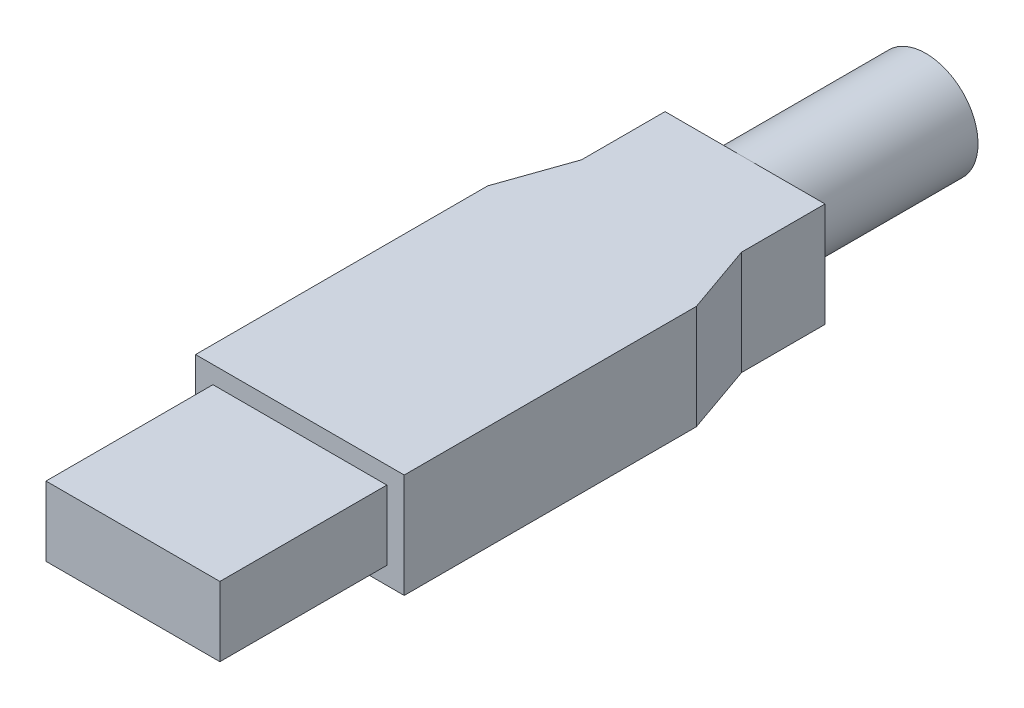
ISO-10303-21;
HEADER;
FILE_DESCRIPTION(('STEP AP214'),'2;1');
FILE_NAME('part.step','',(''),(''),'','','');
FILE_SCHEMA(('AUTOMOTIVE_DESIGN { 1 0 10303 214 1 1 1 1 }'));
ENDSEC;
DATA;
#1=APPLICATION_CONTEXT('core data for automotive mechanical design processes');
#2=APPLICATION_PROTOCOL_DEFINITION('international standard','automotive_design',2000,#1);
#3=PRODUCT_CONTEXT('',#1,'mechanical');
#4=PRODUCT('Part','Part','',(#3));
#5=PRODUCT_RELATED_PRODUCT_CATEGORY('part','',(#4));
#6=PRODUCT_DEFINITION_FORMATION('','',#4);
#7=PRODUCT_DEFINITION_CONTEXT('part definition',#1,'design');
#8=PRODUCT_DEFINITION('design','',#6,#7);
#9=PRODUCT_DEFINITION_SHAPE('','',#8);
#10=(LENGTH_UNIT() NAMED_UNIT(*) SI_UNIT(.MILLI.,.METRE.));
#11=(NAMED_UNIT(*) PLANE_ANGLE_UNIT() SI_UNIT($,.RADIAN.));
#12=(NAMED_UNIT(*) SI_UNIT($,.STERADIAN.) SOLID_ANGLE_UNIT());
#13=UNCERTAINTY_MEASURE_WITH_UNIT(LENGTH_MEASURE(1.E-05),#10,'distance_accuracy_value','');
#14=(GEOMETRIC_REPRESENTATION_CONTEXT(3) GLOBAL_UNCERTAINTY_ASSIGNED_CONTEXT((#13)) GLOBAL_UNIT_ASSIGNED_CONTEXT((#10,
#11,#12)) REPRESENTATION_CONTEXT('',''));
#15=CARTESIAN_POINT('',(0.,0.,0.));
#16=DIRECTION('',(0.,0.,1.));
#17=DIRECTION('',(1.,0.,0.));
#18=AXIS2_PLACEMENT_3D('',#15,#16,#17);
#19=CARTESIAN_POINT('',(-5.75,3.75,-32.));
#20=DIRECTION('',(0.,0.,1.));
#21=DIRECTION('',(1.,0.,0.));
#22=AXIS2_PLACEMENT_3D('',#19,#20,#21);
#23=PLANE('',#22);
#24=CARTESIAN_POINT('',(0.,0.,-32.));
#25=DIRECTION('',(0.,0.,-1.));
#26=DIRECTION('',(-1.,0.,0.));
#27=AXIS2_PLACEMENT_3D('',#24,#25,#26);
#28=CIRCLE('',#27,3.75);
#29=CARTESIAN_POINT('',(0.,3.75,-32.));
#30=VERTEX_POINT('',#29);
#31=CARTESIAN_POINT('',(0.,-3.75,-32.));
#32=VERTEX_POINT('',#31);
#33=EDGE_CURVE('E44',#30,#32,#28,.T.);
#34=ORIENTED_EDGE('',*,*,#33,.F.);
#35=DIRECTION('',(-1.,0.,0.));
#36=VECTOR('',#35,1.);
#37=CARTESIAN_POINT('',(-5.75,3.75,-32.));
#38=LINE('',#37,#36);
#39=CARTESIAN_POINT('',(5.75,3.75,-32.));
#40=VERTEX_POINT('',#39);
#41=EDGE_CURVE('E172',#40,#30,#38,.T.);
#42=ORIENTED_EDGE('',*,*,#41,.F.);
#43=DIRECTION('',(0.,-1.,0.));
#44=VECTOR('',#43,1.);
#45=CARTESIAN_POINT('',(5.75,3.75,-32.));
#46=LINE('',#45,#44);
#47=CARTESIAN_POINT('',(5.75,-3.75,-32.));
#48=VERTEX_POINT('',#47);
#49=EDGE_CURVE('E283',#40,#48,#46,.T.);
#50=ORIENTED_EDGE('',*,*,#49,.T.);
#51=DIRECTION('',(-1.,0.,0.));
#52=VECTOR('',#51,1.);
#53=CARTESIAN_POINT('',(-5.75,-3.75,-32.));
#54=LINE('',#53,#52);
#55=EDGE_CURVE('E190',#48,#32,#54,.T.);
#56=ORIENTED_EDGE('',*,*,#55,.T.);
#57=EDGE_LOOP('',(#34,#42,#50,#56));
#58=FACE_BOUND('',#57,.T.);
#59=ADVANCED_FACE('F34',(#58),#23,.F.);
#60=EDGE_CURVE('E11',#32,#30,#28,.T.);
#61=ORIENTED_EDGE('',*,*,#60,.F.);
#62=CARTESIAN_POINT('',(-5.75,-3.75,-32.));
#63=VERTEX_POINT('',#62);
#64=EDGE_CURVE('E302',#32,#63,#54,.T.);
#65=ORIENTED_EDGE('',*,*,#64,.T.);
#66=DIRECTION('',(0.,-1.,0.));
#67=VECTOR('',#66,1.);
#68=CARTESIAN_POINT('',(-5.75,3.75,-32.));
#69=LINE('',#68,#67);
#70=CARTESIAN_POINT('',(-5.75,3.75,-32.));
#71=VERTEX_POINT('',#70);
#72=EDGE_CURVE('E185',#71,#63,#69,.T.);
#73=ORIENTED_EDGE('',*,*,#72,.F.);
#74=EDGE_CURVE('E174',#30,#71,#38,.T.);
#75=ORIENTED_EDGE('',*,*,#74,.F.);
#76=EDGE_LOOP('',(#61,#65,#73,#75));
#77=FACE_BOUND('',#76,.T.);
#78=ADVANCED_FACE('F183',(#77),#23,.F.);
#79=CARTESIAN_POINT('',(-6.25,2.5,12.));
#80=DIRECTION('',(1.,0.,0.));
#81=DIRECTION('',(0.,1.,0.));
#82=AXIS2_PLACEMENT_3D('',#79,#80,#81);
#83=PLANE('',#82);
#84=DIRECTION('',(0.,-1.,0.));
#85=VECTOR('',#84,1.);
#86=CARTESIAN_POINT('',(-6.25,2.5,0.));
#87=LINE('',#86,#85);
#88=CARTESIAN_POINT('',(-6.25,2.5,0.));
#89=VERTEX_POINT('',#88);
#90=CARTESIAN_POINT('',(-6.25,-2.5,0.));
#91=VERTEX_POINT('',#90);
#92=EDGE_CURVE('E71',#89,#91,#87,.T.);
#93=ORIENTED_EDGE('',*,*,#92,.T.);
#94=DIRECTION('',(0.,0.,-1.));
#95=VECTOR('',#94,1.);
#96=CARTESIAN_POINT('',(-6.25,-2.5,12.));
#97=LINE('',#96,#95);
#98=CARTESIAN_POINT('',(-6.25,-2.5,12.));
#99=VERTEX_POINT('',#98);
#100=EDGE_CURVE('E38',#99,#91,#97,.T.);
#101=ORIENTED_EDGE('',*,*,#100,.F.);
#102=DIRECTION('',(0.,-1.,0.));
#103=VECTOR('',#102,1.);
#104=CARTESIAN_POINT('',(-6.25,2.5,12.));
#105=LINE('',#104,#103);
#106=CARTESIAN_POINT('',(-6.25,2.5,12.));
#107=VERTEX_POINT('',#106);
#108=EDGE_CURVE('E92',#107,#99,#105,.T.);
#109=ORIENTED_EDGE('',*,*,#108,.F.);
#110=DIRECTION('',(0.,0.,-1.));
#111=VECTOR('',#110,1.);
#112=CARTESIAN_POINT('',(-6.25,2.5,12.));
#113=LINE('',#112,#111);
#114=EDGE_CURVE('E105',#107,#89,#113,.T.);
#115=ORIENTED_EDGE('',*,*,#114,.T.);
#116=EDGE_LOOP('',(#93,#101,#109,#115));
#117=FACE_BOUND('',#116,.T.);
#118=ADVANCED_FACE('F36',(#117),#83,.F.);
#119=CARTESIAN_POINT('',(-6.25,-2.5,12.));
#120=DIRECTION('',(0.,1.,0.));
#121=DIRECTION('',(0.,0.,1.));
#122=AXIS2_PLACEMENT_3D('',#119,#120,#121);
#123=PLANE('',#122);
#124=DIRECTION('',(1.,0.,0.));
#125=VECTOR('',#124,1.);
#126=CARTESIAN_POINT('',(-6.25,-2.5,0.));
#127=LINE('',#126,#125);
#128=CARTESIAN_POINT('',(6.25,-2.5,0.));
#129=VERTEX_POINT('',#128);
#130=EDGE_CURVE('E79',#91,#129,#127,.T.);
#131=ORIENTED_EDGE('',*,*,#130,.T.);
#132=DIRECTION('',(0.,0.,-1.));
#133=VECTOR('',#132,1.);
#134=CARTESIAN_POINT('',(6.25,-2.5,12.));
#135=LINE('',#134,#133);
#136=CARTESIAN_POINT('',(6.25,-2.5,12.));
#137=VERTEX_POINT('',#136);
#138=EDGE_CURVE('E97',#137,#129,#135,.T.);
#139=ORIENTED_EDGE('',*,*,#138,.F.);
#140=DIRECTION('',(1.,0.,0.));
#141=VECTOR('',#140,1.);
#142=CARTESIAN_POINT('',(-6.25,-2.5,12.));
#143=LINE('',#142,#141);
#144=EDGE_CURVE('E85',#99,#137,#143,.T.);
#145=ORIENTED_EDGE('',*,*,#144,.F.);
#146=ORIENTED_EDGE('',*,*,#100,.T.);
#147=EDGE_LOOP('',(#131,#139,#145,#146));
#148=FACE_BOUND('',#147,.T.);
#149=ADVANCED_FACE('F98',(#148),#123,.F.);
#150=CARTESIAN_POINT('',(6.25,2.5,12.));
#151=DIRECTION('',(-1.,0.,0.));
#152=DIRECTION('',(0.,0.,1.));
#153=AXIS2_PLACEMENT_3D('',#150,#151,#152);
#154=PLANE('',#153);
#155=DIRECTION('',(0.,1.,0.));
#156=VECTOR('',#155,1.);
#157=CARTESIAN_POINT('',(6.25,2.5,0.));
#158=LINE('',#157,#156);
#159=CARTESIAN_POINT('',(6.25,2.5,0.));
#160=VERTEX_POINT('',#159);
#161=EDGE_CURVE('E112',#129,#160,#158,.T.);
#162=ORIENTED_EDGE('',*,*,#161,.T.);
#163=DIRECTION('',(0.,0.,-1.));
#164=VECTOR('',#163,1.);
#165=CARTESIAN_POINT('',(6.25,2.5,12.));
#166=LINE('',#165,#164);
#167=CARTESIAN_POINT('',(6.25,2.5,12.));
#168=VERTEX_POINT('',#167);
#169=EDGE_CURVE('E101',#168,#160,#166,.T.);
#170=ORIENTED_EDGE('',*,*,#169,.F.);
#171=DIRECTION('',(0.,1.,0.));
#172=VECTOR('',#171,1.);
#173=CARTESIAN_POINT('',(6.25,2.5,12.));
#174=LINE('',#173,#172);
#175=EDGE_CURVE('E89',#137,#168,#174,.T.);
#176=ORIENTED_EDGE('',*,*,#175,.F.);
#177=ORIENTED_EDGE('',*,*,#138,.T.);
#178=EDGE_LOOP('',(#162,#170,#176,#177));
#179=FACE_BOUND('',#178,.T.);
#180=ADVANCED_FACE('F102',(#179),#154,.F.);
#181=CARTESIAN_POINT('',(-6.25,2.5,12.));
#182=DIRECTION('',(0.,-1.,0.));
#183=DIRECTION('',(0.,0.,-1.));
#184=AXIS2_PLACEMENT_3D('',#181,#182,#183);
#185=PLANE('',#184);
#186=DIRECTION('',(-1.,0.,0.));
#187=VECTOR('',#186,1.);
#188=CARTESIAN_POINT('',(-6.25,2.5,0.));
#189=LINE('',#188,#187);
#190=EDGE_CURVE('E114',#160,#89,#189,.T.);
#191=ORIENTED_EDGE('',*,*,#190,.T.);
#192=ORIENTED_EDGE('',*,*,#114,.F.);
#193=DIRECTION('',(-1.,0.,0.));
#194=VECTOR('',#193,1.);
#195=CARTESIAN_POINT('',(-6.25,2.5,12.));
#196=LINE('',#195,#194);
#197=EDGE_CURVE('E58',#168,#107,#196,.T.);
#198=ORIENTED_EDGE('',*,*,#197,.F.);
#199=ORIENTED_EDGE('',*,*,#169,.T.);
#200=EDGE_LOOP('',(#191,#192,#198,#199));
#201=FACE_BOUND('',#200,.T.);
#202=ADVANCED_FACE('F119',(#201),#185,.F.);
#203=CARTESIAN_POINT('',(0.,0.,12.));
#204=DIRECTION('',(0.,0.,1.));
#205=DIRECTION('',(1.,0.,0.));
#206=AXIS2_PLACEMENT_3D('',#203,#204,#205);
#207=PLANE('',#206);
#208=ORIENTED_EDGE('',*,*,#108,.T.);
#209=ORIENTED_EDGE('',*,*,#144,.T.);
#210=ORIENTED_EDGE('',*,*,#175,.T.);
#211=ORIENTED_EDGE('',*,*,#197,.T.);
#212=EDGE_LOOP('',(#208,#209,#210,#211));
#213=FACE_BOUND('',#212,.T.);
#214=ADVANCED_FACE('F87',(#213),#207,.T.);
#215=CARTESIAN_POINT('',(0.,0.,0.));
#216=DIRECTION('',(0.,0.,-1.));
#217=DIRECTION('',(-1.,0.,0.));
#218=AXIS2_PLACEMENT_3D('',#215,#216,#217);
#219=PLANE('',#218);
#220=DIRECTION('',(0.,-1.,0.));
#221=VECTOR('',#220,1.);
#222=CARTESIAN_POINT('',(7.5,3.75,0.));
#223=LINE('',#222,#221);
#224=CARTESIAN_POINT('',(7.5,3.75,0.));
#225=VERTEX_POINT('',#224);
#226=CARTESIAN_POINT('',(7.5,-3.75,0.));
#227=VERTEX_POINT('',#226);
#228=EDGE_CURVE('E274',#225,#227,#223,.T.);
#229=ORIENTED_EDGE('',*,*,#228,.F.);
#230=DIRECTION('',(1.,0.,0.));
#231=VECTOR('',#230,1.);
#232=CARTESIAN_POINT('',(7.5,3.75,0.));
#233=LINE('',#232,#231);
#234=CARTESIAN_POINT('',(-7.5,3.75,0.));
#235=VERTEX_POINT('',#234);
#236=EDGE_CURVE('E267',#235,#225,#233,.T.);
#237=ORIENTED_EDGE('',*,*,#236,.F.);
#238=DIRECTION('',(0.,1.,0.));
#239=VECTOR('',#238,1.);
#240=CARTESIAN_POINT('',(-7.5,3.75,0.));
#241=LINE('',#240,#239);
#242=CARTESIAN_POINT('',(-7.5,-3.75,0.));
#243=VERTEX_POINT('',#242);
#244=EDGE_CURVE('E270',#243,#235,#241,.T.);
#245=ORIENTED_EDGE('',*,*,#244,.F.);
#246=DIRECTION('',(-1.,0.,0.));
#247=VECTOR('',#246,1.);
#248=CARTESIAN_POINT('',(7.5,-3.75,0.));
#249=LINE('',#248,#247);
#250=EDGE_CURVE('E272',#227,#243,#249,.T.);
#251=ORIENTED_EDGE('',*,*,#250,.F.);
#252=EDGE_LOOP('',(#229,#237,#245,#251));
#253=FACE_BOUND('',#252,.T.);
#254=ORIENTED_EDGE('',*,*,#130,.F.);
#255=ORIENTED_EDGE('',*,*,#92,.F.);
#256=ORIENTED_EDGE('',*,*,#190,.F.);
#257=ORIENTED_EDGE('',*,*,#161,.F.);
#258=EDGE_LOOP('',(#254,#255,#256,#257));
#259=FACE_BOUND('',#258,.T.);
#260=ADVANCED_FACE('F224',(#253,#259),#219,.F.);
#261=CARTESIAN_POINT('',(7.5,3.75,-21.));
#262=DIRECTION('',(-1.,0.,0.));
#263=DIRECTION('',(0.,0.,1.));
#264=AXIS2_PLACEMENT_3D('',#261,#262,#263);
#265=PLANE('',#264);
#266=ORIENTED_EDGE('',*,*,#228,.T.);
#267=DIRECTION('',(0.,0.,1.));
#268=VECTOR('',#267,1.);
#269=CARTESIAN_POINT('',(7.5,-3.75,-21.));
#270=LINE('',#269,#268);
#271=CARTESIAN_POINT('',(7.5,-3.75,-21.));
#272=VERTEX_POINT('',#271);
#273=EDGE_CURVE('E110',#272,#227,#270,.T.);
#274=ORIENTED_EDGE('',*,*,#273,.F.);
#275=DIRECTION('',(0.,-1.,0.));
#276=VECTOR('',#275,1.);
#277=CARTESIAN_POINT('',(7.5,3.75,-21.));
#278=LINE('',#277,#276);
#279=CARTESIAN_POINT('',(7.5,3.75,-21.));
#280=VERTEX_POINT('',#279);
#281=EDGE_CURVE('E269',#280,#272,#278,.T.);
#282=ORIENTED_EDGE('',*,*,#281,.F.);
#283=DIRECTION('',(0.,0.,1.));
#284=VECTOR('',#283,1.);
#285=CARTESIAN_POINT('',(7.5,3.75,-21.));
#286=LINE('',#285,#284);
#287=EDGE_CURVE('E263',#280,#225,#286,.T.);
#288=ORIENTED_EDGE('',*,*,#287,.T.);
#289=EDGE_LOOP('',(#266,#274,#282,#288));
#290=FACE_BOUND('',#289,.T.);
#291=ADVANCED_FACE('F227',(#290),#265,.F.);
#292=CARTESIAN_POINT('',(7.5,-3.75,-21.));
#293=DIRECTION('',(0.,1.,0.));
#294=DIRECTION('',(0.,0.,1.));
#295=AXIS2_PLACEMENT_3D('',#292,#293,#294);
#296=PLANE('',#295);
#297=ORIENTED_EDGE('',*,*,#250,.T.);
#298=DIRECTION('',(0.,0.,1.));
#299=VECTOR('',#298,1.);
#300=CARTESIAN_POINT('',(-7.5,-3.75,-21.));
#301=LINE('',#300,#299);
#302=CARTESIAN_POINT('',(-7.5,-3.75,-21.));
#303=VERTEX_POINT('',#302);
#304=EDGE_CURVE('E257',#303,#243,#301,.T.);
#305=ORIENTED_EDGE('',*,*,#304,.F.);
#306=DIRECTION('',(-0.330350424728106,0.,0.943858356366017));
#307=VECTOR('',#306,1.);
#308=CARTESIAN_POINT('',(-7.5,-3.75,-21.));
#309=LINE('',#308,#307);
#310=CARTESIAN_POINT('',(-5.75,-3.75,-26.));
#311=VERTEX_POINT('',#310);
#312=EDGE_CURVE('E295',#311,#303,#309,.T.);
#313=ORIENTED_EDGE('',*,*,#312,.F.);
#314=DIRECTION('',(0.,0.,1.));
#315=VECTOR('',#314,1.);
#316=CARTESIAN_POINT('',(-5.75,-3.75,-26.));
#317=LINE('',#316,#315);
#318=EDGE_CURVE('E298',#63,#311,#317,.T.);
#319=ORIENTED_EDGE('',*,*,#318,.F.);
#320=ORIENTED_EDGE('',*,*,#64,.F.);
#321=ORIENTED_EDGE('',*,*,#55,.F.);
#322=DIRECTION('',(0.,0.,-1.));
#323=VECTOR('',#322,1.);
#324=CARTESIAN_POINT('',(5.75,-3.75,-32.));
#325=LINE('',#324,#323);
#326=CARTESIAN_POINT('',(5.75,-3.75,-26.));
#327=VERTEX_POINT('',#326);
#328=EDGE_CURVE('E303',#327,#48,#325,.T.);
#329=ORIENTED_EDGE('',*,*,#328,.F.);
#330=DIRECTION('',(-0.330350424728106,0.,-0.943858356366017));
#331=VECTOR('',#330,1.);
#332=CARTESIAN_POINT('',(5.75,-3.75,-26.));
#333=LINE('',#332,#331);
#334=EDGE_CURVE('E306',#272,#327,#333,.T.);
#335=ORIENTED_EDGE('',*,*,#334,.F.);
#336=ORIENTED_EDGE('',*,*,#273,.T.);
#337=EDGE_LOOP('',(#297,#305,#313,#319,#320,#321,#329,#335,#336));
#338=FACE_BOUND('',#337,.T.);
#339=ADVANCED_FACE('F234',(#338),#296,.F.);
#340=CARTESIAN_POINT('',(-7.5,3.75,-21.));
#341=DIRECTION('',(1.,0.,0.));
#342=DIRECTION('',(0.,1.,0.));
#343=AXIS2_PLACEMENT_3D('',#340,#341,#342);
#344=PLANE('',#343);
#345=ORIENTED_EDGE('',*,*,#244,.T.);
#346=DIRECTION('',(0.,0.,1.));
#347=VECTOR('',#346,1.);
#348=CARTESIAN_POINT('',(-7.5,3.75,-21.));
#349=LINE('',#348,#347);
#350=CARTESIAN_POINT('',(-7.5,3.75,-21.));
#351=VERTEX_POINT('',#350);
#352=EDGE_CURVE('E260',#351,#235,#349,.T.);
#353=ORIENTED_EDGE('',*,*,#352,.F.);
#354=DIRECTION('',(0.,1.,0.));
#355=VECTOR('',#354,1.);
#356=CARTESIAN_POINT('',(-7.5,3.75,-21.));
#357=LINE('',#356,#355);
#358=EDGE_CURVE('E266',#303,#351,#357,.T.);
#359=ORIENTED_EDGE('',*,*,#358,.F.);
#360=ORIENTED_EDGE('',*,*,#304,.T.);
#361=EDGE_LOOP('',(#345,#353,#359,#360));
#362=FACE_BOUND('',#361,.T.);
#363=ADVANCED_FACE('F231',(#362),#344,.F.);
#364=CARTESIAN_POINT('',(7.5,3.75,-21.));
#365=DIRECTION('',(0.,-1.,0.));
#366=DIRECTION('',(0.,0.,-1.));
#367=AXIS2_PLACEMENT_3D('',#364,#365,#366);
#368=PLANE('',#367);
#369=ORIENTED_EDGE('',*,*,#236,.T.);
#370=ORIENTED_EDGE('',*,*,#287,.F.);
#371=DIRECTION('',(-0.330350424728106,0.,-0.943858356366017));
#372=VECTOR('',#371,1.);
#373=CARTESIAN_POINT('',(5.75,3.75,-26.));
#374=LINE('',#373,#372);
#375=CARTESIAN_POINT('',(5.75,3.75,-26.));
#376=VERTEX_POINT('',#375);
#377=EDGE_CURVE('E293',#280,#376,#374,.T.);
#378=ORIENTED_EDGE('',*,*,#377,.T.);
#379=DIRECTION('',(0.,0.,-1.));
#380=VECTOR('',#379,1.);
#381=CARTESIAN_POINT('',(5.75,3.75,-32.));
#382=LINE('',#381,#380);
#383=EDGE_CURVE('E177',#376,#40,#382,.T.);
#384=ORIENTED_EDGE('',*,*,#383,.T.);
#385=ORIENTED_EDGE('',*,*,#41,.T.);
#386=ORIENTED_EDGE('',*,*,#74,.T.);
#387=DIRECTION('',(0.,0.,1.));
#388=VECTOR('',#387,1.);
#389=CARTESIAN_POINT('',(-5.75,3.75,-26.));
#390=LINE('',#389,#388);
#391=CARTESIAN_POINT('',(-5.75,3.75,-26.));
#392=VERTEX_POINT('',#391);
#393=EDGE_CURVE('E181',#71,#392,#390,.T.);
#394=ORIENTED_EDGE('',*,*,#393,.T.);
#395=DIRECTION('',(-0.330350424728106,0.,0.943858356366017));
#396=VECTOR('',#395,1.);
#397=CARTESIAN_POINT('',(-7.5,3.75,-21.));
#398=LINE('',#397,#396);
#399=EDGE_CURVE('E288',#392,#351,#398,.T.);
#400=ORIENTED_EDGE('',*,*,#399,.T.);
#401=ORIENTED_EDGE('',*,*,#352,.T.);
#402=EDGE_LOOP('',(#369,#370,#378,#384,#385,#386,#394,#400,#401));
#403=FACE_BOUND('',#402,.T.);
#404=ADVANCED_FACE('F173',(#403),#368,.F.);
#405=CARTESIAN_POINT('',(5.75,3.75,-26.));
#406=DIRECTION('',(-0.943858356366017,0.,0.330350424728106));
#407=DIRECTION('',(0.330350424728106,0.,0.943858356366018));
#408=AXIS2_PLACEMENT_3D('',#405,#406,#407);
#409=PLANE('',#408);
#410=ORIENTED_EDGE('',*,*,#281,.T.);
#411=ORIENTED_EDGE('',*,*,#334,.T.);
#412=DIRECTION('',(0.,-1.,0.));
#413=VECTOR('',#412,1.);
#414=CARTESIAN_POINT('',(5.75,3.75,-26.));
#415=LINE('',#414,#413);
#416=EDGE_CURVE('E277',#376,#327,#415,.T.);
#417=ORIENTED_EDGE('',*,*,#416,.F.);
#418=ORIENTED_EDGE('',*,*,#377,.F.);
#419=EDGE_LOOP('',(#410,#411,#417,#418));
#420=FACE_BOUND('',#419,.T.);
#421=ADVANCED_FACE('F219',(#420),#409,.F.);
#422=CARTESIAN_POINT('',(5.75,3.75,-32.));
#423=DIRECTION('',(-1.,0.,0.));
#424=DIRECTION('',(0.,0.,1.));
#425=AXIS2_PLACEMENT_3D('',#422,#423,#424);
#426=PLANE('',#425);
#427=ORIENTED_EDGE('',*,*,#416,.T.);
#428=ORIENTED_EDGE('',*,*,#328,.T.);
#429=ORIENTED_EDGE('',*,*,#49,.F.);
#430=ORIENTED_EDGE('',*,*,#383,.F.);
#431=EDGE_LOOP('',(#427,#428,#429,#430));
#432=FACE_BOUND('',#431,.T.);
#433=ADVANCED_FACE('F216',(#432),#426,.F.);
#434=CARTESIAN_POINT('',(-5.75,3.75,-26.));
#435=DIRECTION('',(1.,0.,0.));
#436=DIRECTION('',(0.,0.,-1.));
#437=AXIS2_PLACEMENT_3D('',#434,#435,#436);
#438=PLANE('',#437);
#439=ORIENTED_EDGE('',*,*,#72,.T.);
#440=ORIENTED_EDGE('',*,*,#318,.T.);
#441=DIRECTION('',(0.,-1.,0.));
#442=VECTOR('',#441,1.);
#443=CARTESIAN_POINT('',(-5.75,3.75,-26.));
#444=LINE('',#443,#442);
#445=EDGE_CURVE('E286',#392,#311,#444,.T.);
#446=ORIENTED_EDGE('',*,*,#445,.F.);
#447=ORIENTED_EDGE('',*,*,#393,.F.);
#448=EDGE_LOOP('',(#439,#440,#446,#447));
#449=FACE_BOUND('',#448,.T.);
#450=ADVANCED_FACE('F205',(#449),#438,.F.);
#451=CARTESIAN_POINT('',(-7.5,3.75,-21.));
#452=DIRECTION('',(0.943858356366017,0.,0.330350424728106));
#453=DIRECTION('',(0.330350424728106,0.,-0.943858356366018));
#454=AXIS2_PLACEMENT_3D('',#451,#452,#453);
#455=PLANE('',#454);
#456=ORIENTED_EDGE('',*,*,#445,.T.);
#457=ORIENTED_EDGE('',*,*,#312,.T.);
#458=ORIENTED_EDGE('',*,*,#358,.T.);
#459=ORIENTED_EDGE('',*,*,#399,.F.);
#460=EDGE_LOOP('',(#456,#457,#458,#459));
#461=FACE_BOUND('',#460,.T.);
#462=ADVANCED_FACE('F196',(#461),#455,.F.);
#463=CARTESIAN_POINT('',(0.,0.,-45.));
#464=DIRECTION('',(0.,0.,1.));
#465=DIRECTION('',(1.,0.,0.));
#466=AXIS2_PLACEMENT_3D('',#463,#464,#465);
#467=CYLINDRICAL_SURFACE('',#466,3.75);
#468=CARTESIAN_POINT('',(0.,0.,-45.));
#469=DIRECTION('',(0.,0.,-1.));
#470=DIRECTION('',(-1.,0.,0.));
#471=AXIS2_PLACEMENT_3D('',#468,#469,#470);
#472=CIRCLE('',#471,3.75);
#473=CARTESIAN_POINT('',(-3.75,0.,-45.));
#474=VERTEX_POINT('',#473);
#475=EDGE_CURVE('E192',#474,#474,#472,.T.);
#476=ORIENTED_EDGE('',*,*,#475,.F.);
#477=EDGE_LOOP('',(#476));
#478=FACE_BOUND('',#477,.T.);
#479=ORIENTED_EDGE('',*,*,#33,.T.);
#480=ORIENTED_EDGE('',*,*,#60,.T.);
#481=EDGE_LOOP('',(#479,#480));
#482=FACE_BOUND('',#481,.T.);
#483=ADVANCED_FACE('F193',(#478,#482),#467,.T.);
#484=CARTESIAN_POINT('',(0.,0.,-45.));
#485=DIRECTION('',(0.,0.,-1.));
#486=DIRECTION('',(-1.,0.,0.));
#487=AXIS2_PLACEMENT_3D('',#484,#485,#486);
#488=PLANE('',#487);
#489=ORIENTED_EDGE('',*,*,#475,.T.);
#490=EDGE_LOOP('',(#489));
#491=FACE_BOUND('',#490,.T.);
#492=ADVANCED_FACE('F195',(#491),#488,.T.);
#493=CLOSED_SHELL('',(#59,#78,#118,#149,#180,#202,#214,#260,#291,#339,#363,#404,#421,#433,#450,
#462,#483,#492));
#494=MANIFOLD_SOLID_BREP('B2',#493);
#495=ADVANCED_BREP_SHAPE_REPRESENTATION('',(#18,#494),#14);
#496=SHAPE_DEFINITION_REPRESENTATION(#9,#495);
ENDSEC;
END-ISO-10303-21;
